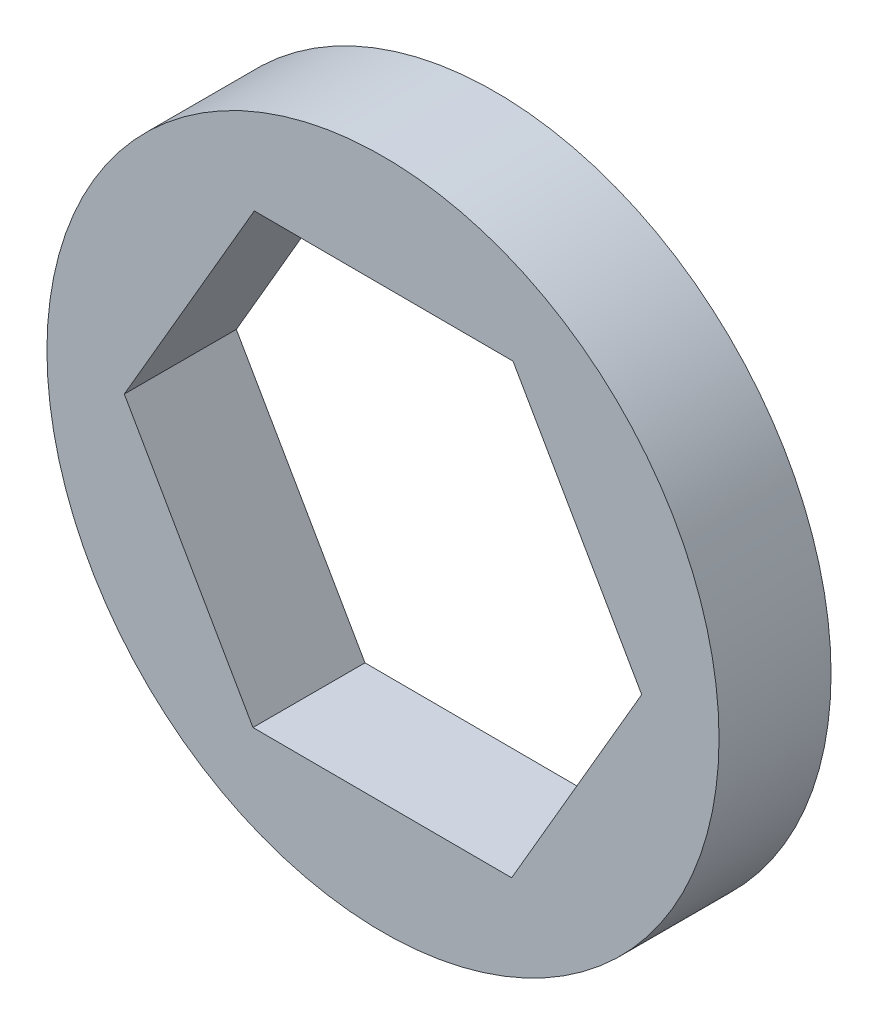
ISO-10303-21;
HEADER;
FILE_DESCRIPTION(('STEP AP214'),'2;1');
FILE_NAME('part.step','',(''),(''),'','','');
FILE_SCHEMA(('AUTOMOTIVE_DESIGN { 1 0 10303 214 1 1 1 1 }'));
ENDSEC;
DATA;
#1=APPLICATION_CONTEXT('core data for automotive mechanical design processes');
#2=APPLICATION_PROTOCOL_DEFINITION('international standard','automotive_design',2000,#1);
#3=PRODUCT_CONTEXT('',#1,'mechanical');
#4=PRODUCT('Part','Part','',(#3));
#5=PRODUCT_RELATED_PRODUCT_CATEGORY('part','',(#4));
#6=PRODUCT_DEFINITION_FORMATION('','',#4);
#7=PRODUCT_DEFINITION_CONTEXT('part definition',#1,'design');
#8=PRODUCT_DEFINITION('design','',#6,#7);
#9=PRODUCT_DEFINITION_SHAPE('','',#8);
#10=(LENGTH_UNIT() NAMED_UNIT(*) SI_UNIT(.MILLI.,.METRE.));
#11=(NAMED_UNIT(*) PLANE_ANGLE_UNIT() SI_UNIT($,.RADIAN.));
#12=(NAMED_UNIT(*) SI_UNIT($,.STERADIAN.) SOLID_ANGLE_UNIT());
#13=UNCERTAINTY_MEASURE_WITH_UNIT(LENGTH_MEASURE(1.E-05),#10,'distance_accuracy_value','');
#14=(GEOMETRIC_REPRESENTATION_CONTEXT(3) GLOBAL_UNCERTAINTY_ASSIGNED_CONTEXT((#13)) GLOBAL_UNIT_ASSIGNED_CONTEXT((#10,
#11,#12)) REPRESENTATION_CONTEXT('',''));
#15=CARTESIAN_POINT('',(0.,0.,0.));
#16=DIRECTION('',(0.,0.,1.));
#17=DIRECTION('',(1.,0.,0.));
#18=AXIS2_PLACEMENT_3D('',#15,#16,#17);
#19=CARTESIAN_POINT('',(0.,0.,3.175));
#20=DIRECTION('',(0.,0.,1.));
#21=DIRECTION('',(1.,0.,0.));
#22=AXIS2_PLACEMENT_3D('',#19,#20,#21);
#23=PLANE('',#22);
#24=CARTESIAN_POINT('',(0.,0.,3.175));
#25=DIRECTION('',(0.,0.,1.));
#26=DIRECTION('',(1.,0.,0.));
#27=AXIS2_PLACEMENT_3D('',#24,#25,#26);
#28=CIRCLE('',#27,9.525);
#29=CARTESIAN_POINT('',(9.525,0.,3.175));
#30=VERTEX_POINT('',#29);
#31=EDGE_CURVE('E11',#30,#30,#28,.T.);
#32=ORIENTED_EDGE('',*,*,#31,.T.);
#33=EDGE_LOOP('',(#32));
#34=FACE_BOUND('',#33,.T.);
#35=DIRECTION('',(0.502611333572125,0.864512491156056,0.));
#36=VECTOR('',#35,1.);
#37=CARTESIAN_POINT('',(3.64699361036975,-6.36103536692381,3.175));
#38=LINE('',#37,#36);
#39=CARTESIAN_POINT('',(3.64699361036975,-6.36103536692381,3.175));
#40=VERTEX_POINT('',#39);
#41=CARTESIAN_POINT('',(7.33231502731217,-0.0221285694421737,3.175));
#42=VERTEX_POINT('',#41);
#43=EDGE_CURVE('E100',#40,#42,#38,.T.);
#44=ORIENTED_EDGE('',*,*,#43,.F.);
#45=DIRECTION('',(0.999995446016177,-0.00301793752540637,0.));
#46=VECTOR('',#45,1.);
#47=CARTESIAN_POINT('',(-3.68532141694241,-6.33890679748164,3.175));
#48=LINE('',#47,#46);
#49=CARTESIAN_POINT('',(-3.68532141694241,-6.33890679748164,3.175));
#50=VERTEX_POINT('',#49);
#51=EDGE_CURVE('E92',#50,#40,#48,.T.);
#52=ORIENTED_EDGE('',*,*,#51,.F.);
#53=DIRECTION('',(0.497384112444053,-0.867530428681462,0.));
#54=VECTOR('',#53,1.);
#55=CARTESIAN_POINT('',(-7.33231502731217,0.022128569442172,3.175));
#56=LINE('',#55,#54);
#57=CARTESIAN_POINT('',(-7.33231502731217,0.022128569442172,3.175));
#58=VERTEX_POINT('',#57);
#59=EDGE_CURVE('E120',#58,#50,#56,.T.);
#60=ORIENTED_EDGE('',*,*,#59,.F.);
#61=DIRECTION('',(-0.502611333572125,-0.864512491156056,0.));
#62=VECTOR('',#61,1.);
#63=CARTESIAN_POINT('',(-3.64699361036976,6.36103536692381,3.175));
#64=LINE('',#63,#62);
#65=CARTESIAN_POINT('',(-3.64699361036976,6.36103536692381,3.175));
#66=VERTEX_POINT('',#65);
#67=EDGE_CURVE('E118',#66,#58,#64,.T.);
#68=ORIENTED_EDGE('',*,*,#67,.F.);
#69=DIRECTION('',(-0.999995446016177,0.00301793752540602,0.));
#70=VECTOR('',#69,1.);
#71=CARTESIAN_POINT('',(3.68532141694241,6.33890679748164,3.175));
#72=LINE('',#71,#70);
#73=CARTESIAN_POINT('',(3.68532141694241,6.33890679748164,3.175));
#74=VERTEX_POINT('',#73);
#75=EDGE_CURVE('E114',#74,#66,#72,.T.);
#76=ORIENTED_EDGE('',*,*,#75,.F.);
#77=DIRECTION('',(-0.497384112444053,0.867530428681462,0.));
#78=VECTOR('',#77,1.);
#79=CARTESIAN_POINT('',(7.33231502731217,-0.0221285694421737,3.175));
#80=LINE('',#79,#78);
#81=EDGE_CURVE('E112',#42,#74,#80,.T.);
#82=ORIENTED_EDGE('',*,*,#81,.F.);
#83=EDGE_LOOP('',(#44,#52,#60,#68,#76,#82));
#84=FACE_BOUND('',#83,.T.);
#85=ADVANCED_FACE('F39',(#34,#84),#23,.T.);
#86=CARTESIAN_POINT('',(0.,0.,0.));
#87=DIRECTION('',(0.,0.,1.));
#88=DIRECTION('',(1.,0.,0.));
#89=AXIS2_PLACEMENT_3D('',#86,#87,#88);
#90=PLANE('',#89);
#91=CARTESIAN_POINT('',(0.,0.,0.));
#92=DIRECTION('',(0.,0.,1.));
#93=DIRECTION('',(1.,0.,0.));
#94=AXIS2_PLACEMENT_3D('',#91,#92,#93);
#95=CIRCLE('',#94,9.525);
#96=CARTESIAN_POINT('',(9.525,0.,0.));
#97=VERTEX_POINT('',#96);
#98=EDGE_CURVE('E43',#97,#97,#95,.T.);
#99=ORIENTED_EDGE('',*,*,#98,.F.);
#100=EDGE_LOOP('',(#99));
#101=FACE_BOUND('',#100,.T.);
#102=DIRECTION('',(0.999995446016177,-0.00301793752540637,0.));
#103=VECTOR('',#102,1.);
#104=CARTESIAN_POINT('',(-3.68532141694241,-6.33890679748164,0.));
#105=LINE('',#104,#103);
#106=CARTESIAN_POINT('',(-3.68532141694241,-6.33890679748164,0.));
#107=VERTEX_POINT('',#106);
#108=CARTESIAN_POINT('',(3.64699361036975,-6.36103536692381,0.));
#109=VERTEX_POINT('',#108);
#110=EDGE_CURVE('E62',#107,#109,#105,.T.);
#111=ORIENTED_EDGE('',*,*,#110,.T.);
#112=DIRECTION('',(0.502611333572125,0.864512491156056,0.));
#113=VECTOR('',#112,1.);
#114=CARTESIAN_POINT('',(3.64699361036975,-6.36103536692381,0.));
#115=LINE('',#114,#113);
#116=CARTESIAN_POINT('',(7.33231502731217,-0.0221285694421737,0.));
#117=VERTEX_POINT('',#116);
#118=EDGE_CURVE('E107',#109,#117,#115,.T.);
#119=ORIENTED_EDGE('',*,*,#118,.T.);
#120=DIRECTION('',(-0.497384112444053,0.867530428681462,0.));
#121=VECTOR('',#120,1.);
#122=CARTESIAN_POINT('',(7.33231502731217,-0.0221285694421737,0.));
#123=LINE('',#122,#121);
#124=CARTESIAN_POINT('',(3.68532141694241,6.33890679748164,0.));
#125=VERTEX_POINT('',#124);
#126=EDGE_CURVE('E124',#117,#125,#123,.T.);
#127=ORIENTED_EDGE('',*,*,#126,.T.);
#128=DIRECTION('',(-0.999995446016177,0.00301793752540602,0.));
#129=VECTOR('',#128,1.);
#130=CARTESIAN_POINT('',(3.68532141694241,6.33890679748164,0.));
#131=LINE('',#130,#129);
#132=CARTESIAN_POINT('',(-3.64699361036976,6.36103536692381,0.));
#133=VERTEX_POINT('',#132);
#134=EDGE_CURVE('E127',#125,#133,#131,.T.);
#135=ORIENTED_EDGE('',*,*,#134,.T.);
#136=DIRECTION('',(-0.502611333572125,-0.864512491156056,0.));
#137=VECTOR('',#136,1.);
#138=CARTESIAN_POINT('',(-3.64699361036976,6.36103536692381,0.));
#139=LINE('',#138,#137);
#140=CARTESIAN_POINT('',(-7.33231502731217,0.022128569442172,0.));
#141=VERTEX_POINT('',#140);
#142=EDGE_CURVE('E130',#133,#141,#139,.T.);
#143=ORIENTED_EDGE('',*,*,#142,.T.);
#144=DIRECTION('',(0.497384112444053,-0.867530428681462,0.));
#145=VECTOR('',#144,1.);
#146=CARTESIAN_POINT('',(-7.33231502731217,0.022128569442172,0.));
#147=LINE('',#146,#145);
#148=EDGE_CURVE('E101',#141,#107,#147,.T.);
#149=ORIENTED_EDGE('',*,*,#148,.T.);
#150=EDGE_LOOP('',(#111,#119,#127,#135,#143,#149));
#151=FACE_BOUND('',#150,.T.);
#152=ADVANCED_FACE('F147',(#101,#151),#90,.F.);
#153=CARTESIAN_POINT('',(0.,0.,3.175));
#154=DIRECTION('',(0.,0.,-1.));
#155=DIRECTION('',(-1.,0.,0.));
#156=AXIS2_PLACEMENT_3D('',#153,#154,#155);
#157=CYLINDRICAL_SURFACE('',#156,9.525);
#158=ORIENTED_EDGE('',*,*,#31,.F.);
#159=EDGE_LOOP('',(#158));
#160=FACE_BOUND('',#159,.T.);
#161=ORIENTED_EDGE('',*,*,#98,.T.);
#162=EDGE_LOOP('',(#161));
#163=FACE_BOUND('',#162,.T.);
#164=ADVANCED_FACE('F41',(#160,#163),#157,.T.);
#165=CARTESIAN_POINT('',(-3.68532141694241,-6.33890679748164,3.175));
#166=DIRECTION('',(0.00301793752540637,0.999995446016177,0.));
#167=DIRECTION('',(-0.999995446016177,0.00301793752540637,0.));
#168=AXIS2_PLACEMENT_3D('',#165,#166,#167);
#169=PLANE('',#168);
#170=ORIENTED_EDGE('',*,*,#110,.F.);
#171=DIRECTION('',(0.,0.,-1.));
#172=VECTOR('',#171,1.);
#173=CARTESIAN_POINT('',(-3.68532141694241,-6.33890679748164,3.175));
#174=LINE('',#173,#172);
#175=EDGE_CURVE('E96',#50,#107,#174,.T.);
#176=ORIENTED_EDGE('',*,*,#175,.F.);
#177=ORIENTED_EDGE('',*,*,#51,.T.);
#178=DIRECTION('',(0.,0.,-1.));
#179=VECTOR('',#178,1.);
#180=CARTESIAN_POINT('',(3.64699361036975,-6.36103536692381,3.175));
#181=LINE('',#180,#179);
#182=EDGE_CURVE('E95',#40,#109,#181,.T.);
#183=ORIENTED_EDGE('',*,*,#182,.T.);
#184=EDGE_LOOP('',(#170,#176,#177,#183));
#185=FACE_BOUND('',#184,.T.);
#186=ADVANCED_FACE('F94',(#185),#169,.T.);
#187=CARTESIAN_POINT('',(3.64699361036975,-6.36103536692381,3.175));
#188=DIRECTION('',(-0.864512491156056,0.502611333572125,0.));
#189=DIRECTION('',(-0.502611333572125,-0.864512491156056,0.));
#190=AXIS2_PLACEMENT_3D('',#187,#188,#189);
#191=PLANE('',#190);
#192=ORIENTED_EDGE('',*,*,#118,.F.);
#193=ORIENTED_EDGE('',*,*,#182,.F.);
#194=ORIENTED_EDGE('',*,*,#43,.T.);
#195=DIRECTION('',(0.,0.,-1.));
#196=VECTOR('',#195,1.);
#197=CARTESIAN_POINT('',(7.33231502731217,-0.0221285694421737,3.175));
#198=LINE('',#197,#196);
#199=EDGE_CURVE('E108',#42,#117,#198,.T.);
#200=ORIENTED_EDGE('',*,*,#199,.T.);
#201=EDGE_LOOP('',(#192,#193,#194,#200));
#202=FACE_BOUND('',#201,.T.);
#203=ADVANCED_FACE('F104',(#202),#191,.T.);
#204=CARTESIAN_POINT('',(7.33231502731217,-0.0221285694421737,3.175));
#205=DIRECTION('',(-0.867530428681462,-0.497384112444053,0.));
#206=DIRECTION('',(0.497384112444053,-0.867530428681462,0.));
#207=AXIS2_PLACEMENT_3D('',#204,#205,#206);
#208=PLANE('',#207);
#209=ORIENTED_EDGE('',*,*,#126,.F.);
#210=ORIENTED_EDGE('',*,*,#199,.F.);
#211=ORIENTED_EDGE('',*,*,#81,.T.);
#212=DIRECTION('',(0.,0.,-1.));
#213=VECTOR('',#212,1.);
#214=CARTESIAN_POINT('',(3.68532141694241,6.33890679748164,3.175));
#215=LINE('',#214,#213);
#216=EDGE_CURVE('E139',#74,#125,#215,.T.);
#217=ORIENTED_EDGE('',*,*,#216,.T.);
#218=EDGE_LOOP('',(#209,#210,#211,#217));
#219=FACE_BOUND('',#218,.T.);
#220=ADVANCED_FACE('F143',(#219),#208,.T.);
#221=CARTESIAN_POINT('',(3.68532141694241,6.33890679748164,3.175));
#222=DIRECTION('',(-0.00301793752540602,-0.999995446016177,0.));
#223=DIRECTION('',(0.999995446016177,-0.00301793752540602,0.));
#224=AXIS2_PLACEMENT_3D('',#221,#222,#223);
#225=PLANE('',#224);
#226=ORIENTED_EDGE('',*,*,#134,.F.);
#227=ORIENTED_EDGE('',*,*,#216,.F.);
#228=ORIENTED_EDGE('',*,*,#75,.T.);
#229=DIRECTION('',(0.,0.,-1.));
#230=VECTOR('',#229,1.);
#231=CARTESIAN_POINT('',(-3.64699361036976,6.36103536692381,3.175));
#232=LINE('',#231,#230);
#233=EDGE_CURVE('E137',#66,#133,#232,.T.);
#234=ORIENTED_EDGE('',*,*,#233,.T.);
#235=EDGE_LOOP('',(#226,#227,#228,#234));
#236=FACE_BOUND('',#235,.T.);
#237=ADVANCED_FACE('F155',(#236),#225,.T.);
#238=CARTESIAN_POINT('',(-3.64699361036976,6.36103536692381,3.175));
#239=DIRECTION('',(0.864512491156056,-0.502611333572125,0.));
#240=DIRECTION('',(0.502611333572125,0.864512491156056,0.));
#241=AXIS2_PLACEMENT_3D('',#238,#239,#240);
#242=PLANE('',#241);
#243=ORIENTED_EDGE('',*,*,#142,.F.);
#244=ORIENTED_EDGE('',*,*,#233,.F.);
#245=ORIENTED_EDGE('',*,*,#67,.T.);
#246=DIRECTION('',(0.,0.,-1.));
#247=VECTOR('',#246,1.);
#248=CARTESIAN_POINT('',(-7.33231502731217,0.022128569442172,3.175));
#249=LINE('',#248,#247);
#250=EDGE_CURVE('E54',#58,#141,#249,.T.);
#251=ORIENTED_EDGE('',*,*,#250,.T.);
#252=EDGE_LOOP('',(#243,#244,#245,#251));
#253=FACE_BOUND('',#252,.T.);
#254=ADVANCED_FACE('F153',(#253),#242,.T.);
#255=CARTESIAN_POINT('',(-7.33231502731217,0.022128569442172,3.175));
#256=DIRECTION('',(0.867530428681462,0.497384112444053,0.));
#257=DIRECTION('',(-0.497384112444053,0.867530428681462,0.));
#258=AXIS2_PLACEMENT_3D('',#255,#256,#257);
#259=PLANE('',#258);
#260=ORIENTED_EDGE('',*,*,#148,.F.);
#261=ORIENTED_EDGE('',*,*,#250,.F.);
#262=ORIENTED_EDGE('',*,*,#59,.T.);
#263=ORIENTED_EDGE('',*,*,#175,.T.);
#264=EDGE_LOOP('',(#260,#261,#262,#263));
#265=FACE_BOUND('',#264,.T.);
#266=ADVANCED_FACE('F149',(#265),#259,.T.);
#267=CLOSED_SHELL('',(#85,#152,#164,#186,#203,#220,#237,#254,#266));
#268=MANIFOLD_SOLID_BREP('B2',#267);
#269=ADVANCED_BREP_SHAPE_REPRESENTATION('',(#18,#268),#14);
#270=SHAPE_DEFINITION_REPRESENTATION(#9,#269);
ENDSEC;
END-ISO-10303-21;
